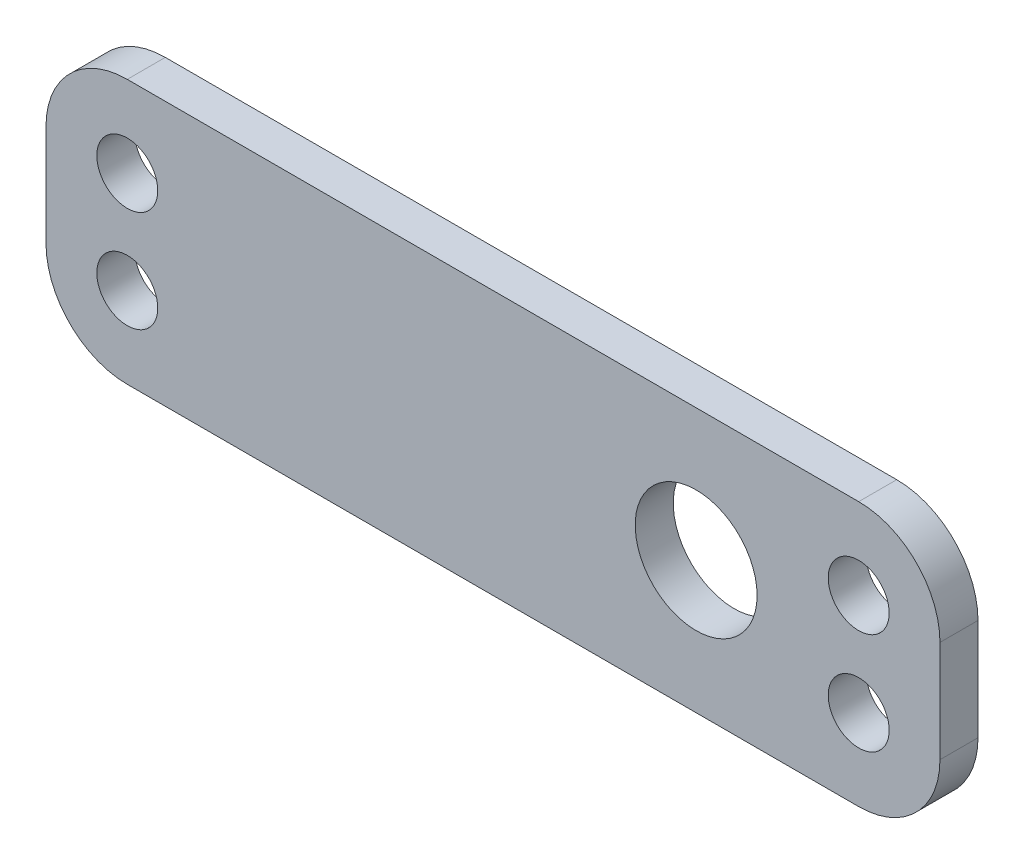
ISO-10303-21;
HEADER;
FILE_DESCRIPTION(('STEP AP214'),'2;1');
FILE_NAME('part.step','',(''),(''),'','','');
FILE_SCHEMA(('AUTOMOTIVE_DESIGN { 1 0 10303 214 1 1 1 1 }'));
ENDSEC;
DATA;
#1=APPLICATION_CONTEXT('core data for automotive mechanical design processes');
#2=APPLICATION_PROTOCOL_DEFINITION('international standard','automotive_design',2000,#1);
#3=PRODUCT_CONTEXT('',#1,'mechanical');
#4=PRODUCT('Part','Part','',(#3));
#5=PRODUCT_RELATED_PRODUCT_CATEGORY('part','',(#4));
#6=PRODUCT_DEFINITION_FORMATION('','',#4);
#7=PRODUCT_DEFINITION_CONTEXT('part definition',#1,'design');
#8=PRODUCT_DEFINITION('design','',#6,#7);
#9=PRODUCT_DEFINITION_SHAPE('','',#8);
#10=(LENGTH_UNIT() NAMED_UNIT(*) SI_UNIT(.MILLI.,.METRE.));
#11=(NAMED_UNIT(*) PLANE_ANGLE_UNIT() SI_UNIT($,.RADIAN.));
#12=(NAMED_UNIT(*) SI_UNIT($,.STERADIAN.) SOLID_ANGLE_UNIT());
#13=UNCERTAINTY_MEASURE_WITH_UNIT(LENGTH_MEASURE(1.E-05),#10,'distance_accuracy_value','');
#14=(GEOMETRIC_REPRESENTATION_CONTEXT(3) GLOBAL_UNCERTAINTY_ASSIGNED_CONTEXT((#13)) GLOBAL_UNIT_ASSIGNED_CONTEXT((#10,
#11,#12)) REPRESENTATION_CONTEXT('',''));
#15=CARTESIAN_POINT('',(0.,0.,0.));
#16=DIRECTION('',(0.,0.,1.));
#17=DIRECTION('',(1.,0.,0.));
#18=AXIS2_PLACEMENT_3D('',#15,#16,#17);
#19=CARTESIAN_POINT('',(0.,0.,2.9718));
#20=DIRECTION('',(0.,0.,1.));
#21=DIRECTION('',(1.,0.,0.));
#22=AXIS2_PLACEMENT_3D('',#19,#20,#21);
#23=PLANE('',#22);
#24=CARTESIAN_POINT('',(15.875,0.,2.9718));
#25=DIRECTION('',(0.,0.,1.));
#26=DIRECTION('',(1.,0.,0.));
#27=AXIS2_PLACEMENT_3D('',#24,#25,#26);
#28=CIRCLE('',#27,4.7625);
#29=CARTESIAN_POINT('',(20.6375,0.,2.9718));
#30=VERTEX_POINT('',#29);
#31=EDGE_CURVE('E250',#30,#30,#28,.T.);
#32=ORIENTED_EDGE('',*,*,#31,.F.);
#33=EDGE_LOOP('',(#32));
#34=FACE_BOUND('',#33,.T.);
#35=CARTESIAN_POINT('',(28.575,3.96875,2.9718));
#36=DIRECTION('',(0.,0.,1.));
#37=DIRECTION('',(1.,0.,0.));
#38=AXIS2_PLACEMENT_3D('',#35,#36,#37);
#39=CIRCLE('',#38,2.38125);
#40=CARTESIAN_POINT('',(30.95625,3.96875,2.9718));
#41=VERTEX_POINT('',#40);
#42=EDGE_CURVE('E230',#41,#41,#39,.T.);
#43=ORIENTED_EDGE('',*,*,#42,.F.);
#44=EDGE_LOOP('',(#43));
#45=FACE_BOUND('',#44,.T.);
#46=CARTESIAN_POINT('',(-28.575,3.96875,2.9718));
#47=DIRECTION('',(0.,0.,1.));
#48=DIRECTION('',(1.,0.,0.));
#49=AXIS2_PLACEMENT_3D('',#46,#47,#48);
#50=CIRCLE('',#49,2.38125);
#51=CARTESIAN_POINT('',(-26.19375,3.96875,2.9718));
#52=VERTEX_POINT('',#51);
#53=EDGE_CURVE('E152',#52,#52,#50,.T.);
#54=ORIENTED_EDGE('',*,*,#53,.F.);
#55=EDGE_LOOP('',(#54));
#56=FACE_BOUND('',#55,.T.);
#57=DIRECTION('',(0.,-1.,0.));
#58=VECTOR('',#57,1.);
#59=CARTESIAN_POINT('',(-34.925,10.31875,2.9718));
#60=LINE('',#59,#58);
#61=CARTESIAN_POINT('',(-34.925,3.96875,2.9718));
#62=VERTEX_POINT('',#61);
#63=CARTESIAN_POINT('',(-34.925,-3.96875,2.9718));
#64=VERTEX_POINT('',#63);
#65=EDGE_CURVE('E158',#62,#64,#60,.T.);
#66=ORIENTED_EDGE('',*,*,#65,.T.);
#67=CARTESIAN_POINT('',(-28.575,-3.96875,2.9718));
#68=DIRECTION('',(0.,0.,1.));
#69=DIRECTION('',(1.,0.,0.));
#70=AXIS2_PLACEMENT_3D('',#67,#68,#69);
#71=CIRCLE('',#70,6.35);
#72=CARTESIAN_POINT('',(-28.575,-10.31875,2.9718));
#73=VERTEX_POINT('',#72);
#74=EDGE_CURVE('E181',#64,#73,#71,.T.);
#75=ORIENTED_EDGE('',*,*,#74,.T.);
#76=DIRECTION('',(1.,0.,0.));
#77=VECTOR('',#76,1.);
#78=CARTESIAN_POINT('',(-34.925,-10.31875,2.9718));
#79=LINE('',#78,#77);
#80=CARTESIAN_POINT('',(28.575,-10.31875,2.9718));
#81=VERTEX_POINT('',#80);
#82=EDGE_CURVE('E134',#73,#81,#79,.T.);
#83=ORIENTED_EDGE('',*,*,#82,.T.);
#84=CARTESIAN_POINT('',(28.575,-3.96875,2.9718));
#85=DIRECTION('',(0.,0.,1.));
#86=DIRECTION('',(1.,0.,0.));
#87=AXIS2_PLACEMENT_3D('',#84,#85,#86);
#88=CIRCLE('',#87,6.35);
#89=CARTESIAN_POINT('',(34.925,-3.96875,2.9718));
#90=VERTEX_POINT('',#89);
#91=EDGE_CURVE('E175',#81,#90,#88,.T.);
#92=ORIENTED_EDGE('',*,*,#91,.T.);
#93=DIRECTION('',(0.,1.,0.));
#94=VECTOR('',#93,1.);
#95=CARTESIAN_POINT('',(34.925,10.31875,2.9718));
#96=LINE('',#95,#94);
#97=CARTESIAN_POINT('',(34.925,3.96875,2.9718));
#98=VERTEX_POINT('',#97);
#99=EDGE_CURVE('E194',#90,#98,#96,.T.);
#100=ORIENTED_EDGE('',*,*,#99,.T.);
#101=CARTESIAN_POINT('',(28.575,3.96875,2.9718));
#102=DIRECTION('',(0.,0.,1.));
#103=DIRECTION('',(1.,0.,0.));
#104=AXIS2_PLACEMENT_3D('',#101,#102,#103);
#105=CIRCLE('',#104,6.35);
#106=CARTESIAN_POINT('',(28.575,10.31875,2.9718));
#107=VERTEX_POINT('',#106);
#108=EDGE_CURVE('E68',#98,#107,#105,.T.);
#109=ORIENTED_EDGE('',*,*,#108,.T.);
#110=DIRECTION('',(-1.,0.,0.));
#111=VECTOR('',#110,1.);
#112=CARTESIAN_POINT('',(-34.925,10.31875,2.9718));
#113=LINE('',#112,#111);
#114=CARTESIAN_POINT('',(-28.575,10.31875,2.9718));
#115=VERTEX_POINT('',#114);
#116=EDGE_CURVE('E160',#107,#115,#113,.T.);
#117=ORIENTED_EDGE('',*,*,#116,.T.);
#118=CARTESIAN_POINT('',(-28.575,3.96875,2.9718));
#119=DIRECTION('',(0.,0.,1.));
#120=DIRECTION('',(1.,0.,0.));
#121=AXIS2_PLACEMENT_3D('',#118,#119,#120);
#122=CIRCLE('',#121,6.35);
#123=EDGE_CURVE('E178',#115,#62,#122,.T.);
#124=ORIENTED_EDGE('',*,*,#123,.T.);
#125=EDGE_LOOP('',(#66,#75,#83,#92,#100,#109,#117,#124));
#126=FACE_BOUND('',#125,.T.);
#127=CARTESIAN_POINT('',(-28.575,-3.96875,2.9718));
#128=DIRECTION('',(0.,0.,1.));
#129=DIRECTION('',(1.,0.,0.));
#130=AXIS2_PLACEMENT_3D('',#127,#128,#129);
#131=CIRCLE('',#130,2.38125);
#132=CARTESIAN_POINT('',(-26.19375,-3.96875,2.9718));
#133=VERTEX_POINT('',#132);
#134=EDGE_CURVE('E222',#133,#133,#131,.T.);
#135=ORIENTED_EDGE('',*,*,#134,.F.);
#136=EDGE_LOOP('',(#135));
#137=FACE_BOUND('',#136,.T.);
#138=CARTESIAN_POINT('',(28.575,-3.96875,2.9718));
#139=DIRECTION('',(0.,0.,1.));
#140=DIRECTION('',(1.,0.,0.));
#141=AXIS2_PLACEMENT_3D('',#138,#139,#140);
#142=CIRCLE('',#141,2.38125);
#143=CARTESIAN_POINT('',(30.95625,-3.96875,2.9718));
#144=VERTEX_POINT('',#143);
#145=EDGE_CURVE('E238',#144,#144,#142,.T.);
#146=ORIENTED_EDGE('',*,*,#145,.F.);
#147=EDGE_LOOP('',(#146));
#148=FACE_BOUND('',#147,.T.);
#149=ADVANCED_FACE('F45',(#34,#45,#56,#126,#137,#148),#23,.T.);
#150=CARTESIAN_POINT('',(0.,0.,0.));
#151=DIRECTION('',(0.,0.,1.));
#152=DIRECTION('',(1.,0.,0.));
#153=AXIS2_PLACEMENT_3D('',#150,#151,#152);
#154=PLANE('',#153);
#155=CARTESIAN_POINT('',(15.875,0.,0.));
#156=DIRECTION('',(0.,0.,1.));
#157=DIRECTION('',(1.,0.,0.));
#158=AXIS2_PLACEMENT_3D('',#155,#156,#157);
#159=CIRCLE('',#158,4.7625);
#160=CARTESIAN_POINT('',(20.6375,0.,0.));
#161=VERTEX_POINT('',#160);
#162=EDGE_CURVE('E246',#161,#161,#159,.T.);
#163=ORIENTED_EDGE('',*,*,#162,.T.);
#164=EDGE_LOOP('',(#163));
#165=FACE_BOUND('',#164,.T.);
#166=DIRECTION('',(1.,0.,0.));
#167=VECTOR('',#166,1.);
#168=CARTESIAN_POINT('',(-34.925,-10.31875,0.));
#169=LINE('',#168,#167);
#170=CARTESIAN_POINT('',(-28.575,-10.31875,0.));
#171=VERTEX_POINT('',#170);
#172=CARTESIAN_POINT('',(28.575,-10.31875,0.));
#173=VERTEX_POINT('',#172);
#174=EDGE_CURVE('E131',#171,#173,#169,.T.);
#175=ORIENTED_EDGE('',*,*,#174,.F.);
#176=CARTESIAN_POINT('',(-28.575,-3.96875,0.));
#177=DIRECTION('',(0.,0.,1.));
#178=DIRECTION('',(1.,0.,0.));
#179=AXIS2_PLACEMENT_3D('',#176,#177,#178);
#180=CIRCLE('',#179,6.35);
#181=CARTESIAN_POINT('',(-34.925,-3.96875,0.));
#182=VERTEX_POINT('',#181);
#183=EDGE_CURVE('E113',#171,#182,#180,.F.);
#184=ORIENTED_EDGE('',*,*,#183,.T.);
#185=DIRECTION('',(0.,-1.,0.));
#186=VECTOR('',#185,1.);
#187=CARTESIAN_POINT('',(-34.925,10.31875,0.));
#188=LINE('',#187,#186);
#189=CARTESIAN_POINT('',(-34.925,3.96875,0.));
#190=VERTEX_POINT('',#189);
#191=EDGE_CURVE('E145',#190,#182,#188,.T.);
#192=ORIENTED_EDGE('',*,*,#191,.F.);
#193=CARTESIAN_POINT('',(-28.575,3.96875,0.));
#194=DIRECTION('',(0.,0.,1.));
#195=DIRECTION('',(1.,0.,0.));
#196=AXIS2_PLACEMENT_3D('',#193,#194,#195);
#197=CIRCLE('',#196,6.35);
#198=CARTESIAN_POINT('',(-28.575,10.31875,0.));
#199=VERTEX_POINT('',#198);
#200=EDGE_CURVE('E125',#190,#199,#197,.F.);
#201=ORIENTED_EDGE('',*,*,#200,.T.);
#202=DIRECTION('',(-1.,0.,0.));
#203=VECTOR('',#202,1.);
#204=CARTESIAN_POINT('',(-34.925,10.31875,0.));
#205=LINE('',#204,#203);
#206=CARTESIAN_POINT('',(28.575,10.31875,0.));
#207=VERTEX_POINT('',#206);
#208=EDGE_CURVE('E150',#207,#199,#205,.T.);
#209=ORIENTED_EDGE('',*,*,#208,.F.);
#210=CARTESIAN_POINT('',(28.575,3.96875,0.));
#211=DIRECTION('',(0.,0.,1.));
#212=DIRECTION('',(1.,0.,0.));
#213=AXIS2_PLACEMENT_3D('',#210,#211,#212);
#214=CIRCLE('',#213,6.35);
#215=CARTESIAN_POINT('',(34.925,3.96875,0.));
#216=VERTEX_POINT('',#215);
#217=EDGE_CURVE('E136',#207,#216,#214,.F.);
#218=ORIENTED_EDGE('',*,*,#217,.T.);
#219=DIRECTION('',(0.,1.,0.));
#220=VECTOR('',#219,1.);
#221=CARTESIAN_POINT('',(34.925,10.31875,0.));
#222=LINE('',#221,#220);
#223=CARTESIAN_POINT('',(34.925,-3.96875,0.));
#224=VERTEX_POINT('',#223);
#225=EDGE_CURVE('E144',#224,#216,#222,.T.);
#226=ORIENTED_EDGE('',*,*,#225,.F.);
#227=CARTESIAN_POINT('',(28.575,-3.96875,0.));
#228=DIRECTION('',(0.,0.,1.));
#229=DIRECTION('',(1.,0.,0.));
#230=AXIS2_PLACEMENT_3D('',#227,#228,#229);
#231=CIRCLE('',#230,6.35);
#232=EDGE_CURVE('E142',#224,#173,#231,.F.);
#233=ORIENTED_EDGE('',*,*,#232,.T.);
#234=EDGE_LOOP('',(#175,#184,#192,#201,#209,#218,#226,#233));
#235=FACE_BOUND('',#234,.T.);
#236=CARTESIAN_POINT('',(-28.575,3.96875,0.));
#237=DIRECTION('',(0.,0.,1.));
#238=DIRECTION('',(1.,0.,0.));
#239=AXIS2_PLACEMENT_3D('',#236,#237,#238);
#240=CIRCLE('',#239,2.38125);
#241=CARTESIAN_POINT('',(-26.19375,3.96875,0.));
#242=VERTEX_POINT('',#241);
#243=EDGE_CURVE('E217',#242,#242,#240,.T.);
#244=ORIENTED_EDGE('',*,*,#243,.T.);
#245=EDGE_LOOP('',(#244));
#246=FACE_BOUND('',#245,.T.);
#247=CARTESIAN_POINT('',(-28.575,-3.96875,0.));
#248=DIRECTION('',(0.,0.,1.));
#249=DIRECTION('',(1.,0.,0.));
#250=AXIS2_PLACEMENT_3D('',#247,#248,#249);
#251=CIRCLE('',#250,2.38125);
#252=CARTESIAN_POINT('',(-26.19375,-3.96875,0.));
#253=VERTEX_POINT('',#252);
#254=EDGE_CURVE('E226',#253,#253,#251,.T.);
#255=ORIENTED_EDGE('',*,*,#254,.T.);
#256=EDGE_LOOP('',(#255));
#257=FACE_BOUND('',#256,.T.);
#258=CARTESIAN_POINT('',(28.575,3.96875,0.));
#259=DIRECTION('',(0.,0.,1.));
#260=DIRECTION('',(1.,0.,0.));
#261=AXIS2_PLACEMENT_3D('',#258,#259,#260);
#262=CIRCLE('',#261,2.38125);
#263=CARTESIAN_POINT('',(30.95625,3.96875,0.));
#264=VERTEX_POINT('',#263);
#265=EDGE_CURVE('E234',#264,#264,#262,.T.);
#266=ORIENTED_EDGE('',*,*,#265,.T.);
#267=EDGE_LOOP('',(#266));
#268=FACE_BOUND('',#267,.T.);
#269=CARTESIAN_POINT('',(28.575,-3.96875,0.));
#270=DIRECTION('',(0.,0.,1.));
#271=DIRECTION('',(1.,0.,0.));
#272=AXIS2_PLACEMENT_3D('',#269,#270,#271);
#273=CIRCLE('',#272,2.38125);
#274=CARTESIAN_POINT('',(30.95625,-3.96875,0.));
#275=VERTEX_POINT('',#274);
#276=EDGE_CURVE('E242',#275,#275,#273,.T.);
#277=ORIENTED_EDGE('',*,*,#276,.T.);
#278=EDGE_LOOP('',(#277));
#279=FACE_BOUND('',#278,.T.);
#280=ADVANCED_FACE('F139',(#165,#235,#246,#257,#268,#279),#154,.F.);
#281=CARTESIAN_POINT('',(-34.925,10.31875,2.9718));
#282=DIRECTION('',(1.,0.,0.));
#283=DIRECTION('',(0.,0.,-1.));
#284=AXIS2_PLACEMENT_3D('',#281,#282,#283);
#285=PLANE('',#284);
#286=ORIENTED_EDGE('',*,*,#191,.T.);
#287=DIRECTION('',(0.,0.,-1.));
#288=VECTOR('',#287,1.);
#289=CARTESIAN_POINT('',(-34.925,-3.96875,2.9718));
#290=LINE('',#289,#288);
#291=EDGE_CURVE('E118',#182,#64,#290,.F.);
#292=ORIENTED_EDGE('',*,*,#291,.T.);
#293=ORIENTED_EDGE('',*,*,#65,.F.);
#294=DIRECTION('',(0.,0.,-1.));
#295=VECTOR('',#294,1.);
#296=CARTESIAN_POINT('',(-34.925,3.96875,2.9718));
#297=LINE('',#296,#295);
#298=EDGE_CURVE('E124',#62,#190,#297,.T.);
#299=ORIENTED_EDGE('',*,*,#298,.T.);
#300=EDGE_LOOP('',(#286,#292,#293,#299));
#301=FACE_BOUND('',#300,.T.);
#302=ADVANCED_FACE('F211',(#301),#285,.F.);
#303=CARTESIAN_POINT('',(-34.925,-10.31875,2.9718));
#304=DIRECTION('',(0.,1.,0.));
#305=DIRECTION('',(0.,0.,1.));
#306=AXIS2_PLACEMENT_3D('',#303,#304,#305);
#307=PLANE('',#306);
#308=ORIENTED_EDGE('',*,*,#82,.F.);
#309=DIRECTION('',(0.,0.,-1.));
#310=VECTOR('',#309,1.);
#311=CARTESIAN_POINT('',(-28.575,-10.31875,2.9718));
#312=LINE('',#311,#310);
#313=EDGE_CURVE('E117',#73,#171,#312,.T.);
#314=ORIENTED_EDGE('',*,*,#313,.T.);
#315=ORIENTED_EDGE('',*,*,#174,.T.);
#316=DIRECTION('',(0.,0.,-1.));
#317=VECTOR('',#316,1.);
#318=CARTESIAN_POINT('',(28.575,-10.31875,2.9718));
#319=LINE('',#318,#317);
#320=EDGE_CURVE('E137',#173,#81,#319,.F.);
#321=ORIENTED_EDGE('',*,*,#320,.T.);
#322=EDGE_LOOP('',(#308,#314,#315,#321));
#323=FACE_BOUND('',#322,.T.);
#324=ADVANCED_FACE('F130',(#323),#307,.F.);
#325=CARTESIAN_POINT('',(34.925,10.31875,2.9718));
#326=DIRECTION('',(-1.,0.,0.));
#327=DIRECTION('',(0.,0.,1.));
#328=AXIS2_PLACEMENT_3D('',#325,#326,#327);
#329=PLANE('',#328);
#330=ORIENTED_EDGE('',*,*,#99,.F.);
#331=DIRECTION('',(0.,0.,-1.));
#332=VECTOR('',#331,1.);
#333=CARTESIAN_POINT('',(34.925,-3.96875,2.9718));
#334=LINE('',#333,#332);
#335=EDGE_CURVE('E11',#90,#224,#334,.T.);
#336=ORIENTED_EDGE('',*,*,#335,.T.);
#337=ORIENTED_EDGE('',*,*,#225,.T.);
#338=DIRECTION('',(0.,0.,-1.));
#339=VECTOR('',#338,1.);
#340=CARTESIAN_POINT('',(34.925,3.96875,2.9718));
#341=LINE('',#340,#339);
#342=EDGE_CURVE('E54',#216,#98,#341,.F.);
#343=ORIENTED_EDGE('',*,*,#342,.T.);
#344=EDGE_LOOP('',(#330,#336,#337,#343));
#345=FACE_BOUND('',#344,.T.);
#346=ADVANCED_FACE('F193',(#345),#329,.F.);
#347=CARTESIAN_POINT('',(-34.925,10.31875,2.9718));
#348=DIRECTION('',(0.,-1.,0.));
#349=DIRECTION('',(0.,0.,-1.));
#350=AXIS2_PLACEMENT_3D('',#347,#348,#349);
#351=PLANE('',#350);
#352=ORIENTED_EDGE('',*,*,#208,.T.);
#353=DIRECTION('',(0.,0.,-1.));
#354=VECTOR('',#353,1.);
#355=CARTESIAN_POINT('',(-28.575,10.31875,2.9718));
#356=LINE('',#355,#354);
#357=EDGE_CURVE('E61',#199,#115,#356,.F.);
#358=ORIENTED_EDGE('',*,*,#357,.T.);
#359=ORIENTED_EDGE('',*,*,#116,.F.);
#360=DIRECTION('',(0.,0.,-1.));
#361=VECTOR('',#360,1.);
#362=CARTESIAN_POINT('',(28.575,10.31875,2.9718));
#363=LINE('',#362,#361);
#364=EDGE_CURVE('E184',#107,#207,#363,.T.);
#365=ORIENTED_EDGE('',*,*,#364,.T.);
#366=EDGE_LOOP('',(#352,#358,#359,#365));
#367=FACE_BOUND('',#366,.T.);
#368=ADVANCED_FACE('F204',(#367),#351,.F.);
#369=CARTESIAN_POINT('',(-28.575,3.96875,2.9718));
#370=DIRECTION('',(0.,0.,-1.));
#371=DIRECTION('',(-1.,0.,0.));
#372=AXIS2_PLACEMENT_3D('',#369,#370,#371);
#373=CYLINDRICAL_SURFACE('',#372,2.38125);
#374=ORIENTED_EDGE('',*,*,#53,.T.);
#375=EDGE_LOOP('',(#374));
#376=FACE_BOUND('',#375,.T.);
#377=ORIENTED_EDGE('',*,*,#243,.F.);
#378=EDGE_LOOP('',(#377));
#379=FACE_BOUND('',#378,.T.);
#380=ADVANCED_FACE('F272',(#376,#379),#373,.F.);
#381=CARTESIAN_POINT('',(-28.575,-3.96875,2.9718));
#382=DIRECTION('',(0.,0.,-1.));
#383=DIRECTION('',(-1.,0.,0.));
#384=AXIS2_PLACEMENT_3D('',#381,#382,#383);
#385=CYLINDRICAL_SURFACE('',#384,2.38125);
#386=ORIENTED_EDGE('',*,*,#134,.T.);
#387=EDGE_LOOP('',(#386));
#388=FACE_BOUND('',#387,.T.);
#389=ORIENTED_EDGE('',*,*,#254,.F.);
#390=EDGE_LOOP('',(#389));
#391=FACE_BOUND('',#390,.T.);
#392=ADVANCED_FACE('F275',(#388,#391),#385,.F.);
#393=CARTESIAN_POINT('',(28.575,3.96875,2.9718));
#394=DIRECTION('',(0.,0.,-1.));
#395=DIRECTION('',(-1.,0.,0.));
#396=AXIS2_PLACEMENT_3D('',#393,#394,#395);
#397=CYLINDRICAL_SURFACE('',#396,2.38125);
#398=ORIENTED_EDGE('',*,*,#42,.T.);
#399=EDGE_LOOP('',(#398));
#400=FACE_BOUND('',#399,.T.);
#401=ORIENTED_EDGE('',*,*,#265,.F.);
#402=EDGE_LOOP('',(#401));
#403=FACE_BOUND('',#402,.T.);
#404=ADVANCED_FACE('F289',(#400,#403),#397,.F.);
#405=CARTESIAN_POINT('',(28.575,-3.96875,2.9718));
#406=DIRECTION('',(0.,0.,-1.));
#407=DIRECTION('',(-1.,0.,0.));
#408=AXIS2_PLACEMENT_3D('',#405,#406,#407);
#409=CYLINDRICAL_SURFACE('',#408,2.38125);
#410=ORIENTED_EDGE('',*,*,#145,.T.);
#411=EDGE_LOOP('',(#410));
#412=FACE_BOUND('',#411,.T.);
#413=ORIENTED_EDGE('',*,*,#276,.F.);
#414=EDGE_LOOP('',(#413));
#415=FACE_BOUND('',#414,.T.);
#416=ADVANCED_FACE('F287',(#412,#415),#409,.F.);
#417=CARTESIAN_POINT('',(-28.575,-3.96875,2.9718));
#418=DIRECTION('',(0.,0.,-1.));
#419=DIRECTION('',(-1.,0.,0.));
#420=AXIS2_PLACEMENT_3D('',#417,#418,#419);
#421=CYLINDRICAL_SURFACE('',#420,6.35);
#422=ORIENTED_EDGE('',*,*,#74,.F.);
#423=ORIENTED_EDGE('',*,*,#291,.F.);
#424=ORIENTED_EDGE('',*,*,#183,.F.);
#425=ORIENTED_EDGE('',*,*,#313,.F.);
#426=EDGE_LOOP('',(#422,#423,#424,#425));
#427=FACE_BOUND('',#426,.T.);
#428=ADVANCED_FACE('F116',(#427),#421,.T.);
#429=CARTESIAN_POINT('',(-28.575,3.96875,2.9718));
#430=DIRECTION('',(0.,0.,-1.));
#431=DIRECTION('',(-1.,0.,0.));
#432=AXIS2_PLACEMENT_3D('',#429,#430,#431);
#433=CYLINDRICAL_SURFACE('',#432,6.35);
#434=ORIENTED_EDGE('',*,*,#123,.F.);
#435=ORIENTED_EDGE('',*,*,#357,.F.);
#436=ORIENTED_EDGE('',*,*,#200,.F.);
#437=ORIENTED_EDGE('',*,*,#298,.F.);
#438=EDGE_LOOP('',(#434,#435,#436,#437));
#439=FACE_BOUND('',#438,.T.);
#440=ADVANCED_FACE('F208',(#439),#433,.T.);
#441=CARTESIAN_POINT('',(28.575,-3.96875,2.9718));
#442=DIRECTION('',(0.,0.,-1.));
#443=DIRECTION('',(-1.,0.,0.));
#444=AXIS2_PLACEMENT_3D('',#441,#442,#443);
#445=CYLINDRICAL_SURFACE('',#444,6.35);
#446=ORIENTED_EDGE('',*,*,#91,.F.);
#447=ORIENTED_EDGE('',*,*,#320,.F.);
#448=ORIENTED_EDGE('',*,*,#232,.F.);
#449=ORIENTED_EDGE('',*,*,#335,.F.);
#450=EDGE_LOOP('',(#446,#447,#448,#449));
#451=FACE_BOUND('',#450,.T.);
#452=ADVANCED_FACE('F312',(#451),#445,.T.);
#453=CARTESIAN_POINT('',(28.575,3.96875,2.9718));
#454=DIRECTION('',(0.,0.,-1.));
#455=DIRECTION('',(-1.,0.,0.));
#456=AXIS2_PLACEMENT_3D('',#453,#454,#455);
#457=CYLINDRICAL_SURFACE('',#456,6.35);
#458=ORIENTED_EDGE('',*,*,#108,.F.);
#459=ORIENTED_EDGE('',*,*,#342,.F.);
#460=ORIENTED_EDGE('',*,*,#217,.F.);
#461=ORIENTED_EDGE('',*,*,#364,.F.);
#462=EDGE_LOOP('',(#458,#459,#460,#461));
#463=FACE_BOUND('',#462,.T.);
#464=ADVANCED_FACE('F47',(#463),#457,.T.);
#465=CARTESIAN_POINT('',(15.875,0.,0.));
#466=DIRECTION('',(0.,0.,1.));
#467=DIRECTION('',(1.,0.,0.));
#468=AXIS2_PLACEMENT_3D('',#465,#466,#467);
#469=CYLINDRICAL_SURFACE('',#468,4.7625);
#470=ORIENTED_EDGE('',*,*,#162,.F.);
#471=EDGE_LOOP('',(#470));
#472=FACE_BOUND('',#471,.T.);
#473=ORIENTED_EDGE('',*,*,#31,.T.);
#474=EDGE_LOOP('',(#473));
#475=FACE_BOUND('',#474,.T.);
#476=ADVANCED_FACE('F259',(#472,#475),#469,.F.);
#477=CLOSED_SHELL('',(#149,#280,#302,#324,#346,#368,#380,#392,#404,#416,#428,#440,#452,#464,#476));
#478=MANIFOLD_SOLID_BREP('B2',#477);
#479=ADVANCED_BREP_SHAPE_REPRESENTATION('',(#18,#478),#14);
#480=SHAPE_DEFINITION_REPRESENTATION(#9,#479);
ENDSEC;
END-ISO-10303-21;
